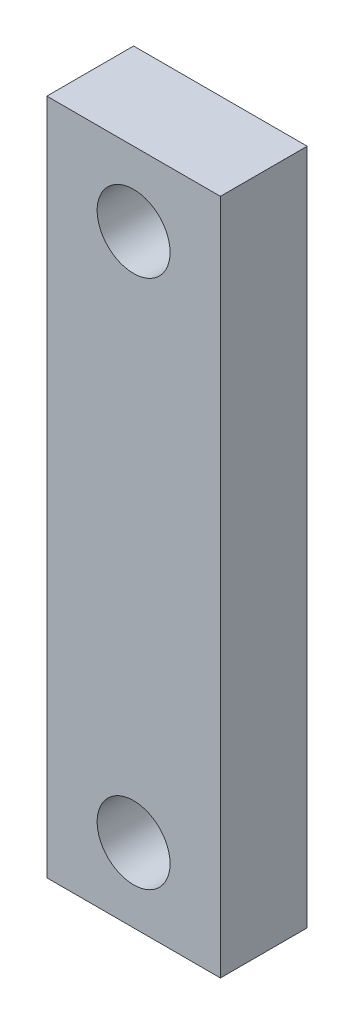
ISO-10303-21;
HEADER;
FILE_DESCRIPTION(('STEP AP214'),'2;1');
FILE_NAME('part.step','',(''),(''),'','','');
FILE_SCHEMA(('AUTOMOTIVE_DESIGN { 1 0 10303 214 1 1 1 1 }'));
ENDSEC;
DATA;
#1=APPLICATION_CONTEXT('core data for automotive mechanical design processes');
#2=APPLICATION_PROTOCOL_DEFINITION('international standard','automotive_design',2000,#1);
#3=PRODUCT_CONTEXT('',#1,'mechanical');
#4=PRODUCT('Part','Part','',(#3));
#5=PRODUCT_RELATED_PRODUCT_CATEGORY('part','',(#4));
#6=PRODUCT_DEFINITION_FORMATION('','',#4);
#7=PRODUCT_DEFINITION_CONTEXT('part definition',#1,'design');
#8=PRODUCT_DEFINITION('design','',#6,#7);
#9=PRODUCT_DEFINITION_SHAPE('','',#8);
#10=(LENGTH_UNIT() NAMED_UNIT(*) SI_UNIT(.MILLI.,.METRE.));
#11=(NAMED_UNIT(*) PLANE_ANGLE_UNIT() SI_UNIT($,.RADIAN.));
#12=(NAMED_UNIT(*) SI_UNIT($,.STERADIAN.) SOLID_ANGLE_UNIT());
#13=UNCERTAINTY_MEASURE_WITH_UNIT(LENGTH_MEASURE(1.E-05),#10,'distance_accuracy_value','');
#14=(GEOMETRIC_REPRESENTATION_CONTEXT(3) GLOBAL_UNCERTAINTY_ASSIGNED_CONTEXT((#13)) GLOBAL_UNIT_ASSIGNED_CONTEXT((#10,
#11,#12)) REPRESENTATION_CONTEXT('',''));
#15=CARTESIAN_POINT('',(0.,0.,0.));
#16=DIRECTION('',(0.,0.,1.));
#17=DIRECTION('',(1.,0.,0.));
#18=AXIS2_PLACEMENT_3D('',#15,#16,#17);
#19=CARTESIAN_POINT('',(-10.,39.,10.));
#20=DIRECTION('',(1.,0.,0.));
#21=DIRECTION('',(0.,1.,0.));
#22=AXIS2_PLACEMENT_3D('',#19,#20,#21);
#23=PLANE('',#22);
#24=DIRECTION('',(0.,-1.,0.));
#25=VECTOR('',#24,1.);
#26=CARTESIAN_POINT('',(-10.,39.,0.));
#27=LINE('',#26,#25);
#28=CARTESIAN_POINT('',(-10.,39.,0.));
#29=VERTEX_POINT('',#28);
#30=CARTESIAN_POINT('',(-10.,-39.,0.));
#31=VERTEX_POINT('',#30);
#32=EDGE_CURVE('E107',#29,#31,#27,.T.);
#33=ORIENTED_EDGE('',*,*,#32,.T.);
#34=DIRECTION('',(0.,0.,-1.));
#35=VECTOR('',#34,1.);
#36=CARTESIAN_POINT('',(-10.,-39.,10.));
#37=LINE('',#36,#35);
#38=CARTESIAN_POINT('',(-10.,-39.,10.));
#39=VERTEX_POINT('',#38);
#40=EDGE_CURVE('E11',#39,#31,#37,.T.);
#41=ORIENTED_EDGE('',*,*,#40,.F.);
#42=DIRECTION('',(0.,-1.,0.));
#43=VECTOR('',#42,1.);
#44=CARTESIAN_POINT('',(-10.,39.,10.));
#45=LINE('',#44,#43);
#46=CARTESIAN_POINT('',(-10.,39.,10.));
#47=VERTEX_POINT('',#46);
#48=EDGE_CURVE('E91',#47,#39,#45,.T.);
#49=ORIENTED_EDGE('',*,*,#48,.F.);
#50=DIRECTION('',(0.,0.,-1.));
#51=VECTOR('',#50,1.);
#52=CARTESIAN_POINT('',(-10.,39.,10.));
#53=LINE('',#52,#51);
#54=EDGE_CURVE('E103',#47,#29,#53,.T.);
#55=ORIENTED_EDGE('',*,*,#54,.T.);
#56=EDGE_LOOP('',(#33,#41,#49,#55));
#57=FACE_BOUND('',#56,.T.);
#58=ADVANCED_FACE('F39',(#57),#23,.F.);
#59=CARTESIAN_POINT('',(10.,-39.,10.));
#60=DIRECTION('',(0.,1.,0.));
#61=DIRECTION('',(-1.,0.,0.));
#62=AXIS2_PLACEMENT_3D('',#59,#60,#61);
#63=PLANE('',#62);
#64=DIRECTION('',(1.,0.,0.));
#65=VECTOR('',#64,1.);
#66=CARTESIAN_POINT('',(10.,-39.,0.));
#67=LINE('',#66,#65);
#68=CARTESIAN_POINT('',(10.,-39.,0.));
#69=VERTEX_POINT('',#68);
#70=EDGE_CURVE('E96',#31,#69,#67,.T.);
#71=ORIENTED_EDGE('',*,*,#70,.T.);
#72=DIRECTION('',(0.,0.,-1.));
#73=VECTOR('',#72,1.);
#74=CARTESIAN_POINT('',(10.,-39.,10.));
#75=LINE('',#74,#73);
#76=CARTESIAN_POINT('',(10.,-39.,10.));
#77=VERTEX_POINT('',#76);
#78=EDGE_CURVE('E48',#77,#69,#75,.T.);
#79=ORIENTED_EDGE('',*,*,#78,.F.);
#80=DIRECTION('',(1.,0.,0.));
#81=VECTOR('',#80,1.);
#82=CARTESIAN_POINT('',(10.,-39.,10.));
#83=LINE('',#82,#81);
#84=EDGE_CURVE('E86',#39,#77,#83,.T.);
#85=ORIENTED_EDGE('',*,*,#84,.F.);
#86=ORIENTED_EDGE('',*,*,#40,.T.);
#87=EDGE_LOOP('',(#71,#79,#85,#86));
#88=FACE_BOUND('',#87,.T.);
#89=ADVANCED_FACE('F95',(#88),#63,.F.);
#90=CARTESIAN_POINT('',(9.99999999999999,39.,10.));
#91=DIRECTION('',(-1.,0.,0.));
#92=DIRECTION('',(0.,-1.,0.));
#93=AXIS2_PLACEMENT_3D('',#90,#91,#92);
#94=PLANE('',#93);
#95=DIRECTION('',(0.,1.,0.));
#96=VECTOR('',#95,1.);
#97=CARTESIAN_POINT('',(9.99999999999999,39.,0.));
#98=LINE('',#97,#96);
#99=CARTESIAN_POINT('',(9.99999999999999,39.,0.));
#100=VERTEX_POINT('',#99);
#101=EDGE_CURVE('E73',#69,#100,#98,.T.);
#102=ORIENTED_EDGE('',*,*,#101,.T.);
#103=DIRECTION('',(0.,0.,-1.));
#104=VECTOR('',#103,1.);
#105=CARTESIAN_POINT('',(9.99999999999999,39.,10.));
#106=LINE('',#105,#104);
#107=CARTESIAN_POINT('',(9.99999999999999,39.,10.));
#108=VERTEX_POINT('',#107);
#109=EDGE_CURVE('E98',#108,#100,#106,.T.);
#110=ORIENTED_EDGE('',*,*,#109,.F.);
#111=DIRECTION('',(0.,1.,0.));
#112=VECTOR('',#111,1.);
#113=CARTESIAN_POINT('',(9.99999999999999,39.,10.));
#114=LINE('',#113,#112);
#115=EDGE_CURVE('E89',#77,#108,#114,.T.);
#116=ORIENTED_EDGE('',*,*,#115,.F.);
#117=ORIENTED_EDGE('',*,*,#78,.T.);
#118=EDGE_LOOP('',(#102,#110,#116,#117));
#119=FACE_BOUND('',#118,.T.);
#120=ADVANCED_FACE('F99',(#119),#94,.F.);
#121=CARTESIAN_POINT('',(9.99999999999999,39.,10.));
#122=DIRECTION('',(0.,-1.,0.));
#123=DIRECTION('',(0.,0.,-1.));
#124=AXIS2_PLACEMENT_3D('',#121,#122,#123);
#125=PLANE('',#124);
#126=DIRECTION('',(-1.,0.,0.));
#127=VECTOR('',#126,1.);
#128=CARTESIAN_POINT('',(9.99999999999999,39.,0.));
#129=LINE('',#128,#127);
#130=EDGE_CURVE('E79',#100,#29,#129,.T.);
#131=ORIENTED_EDGE('',*,*,#130,.T.);
#132=ORIENTED_EDGE('',*,*,#54,.F.);
#133=DIRECTION('',(-1.,0.,0.));
#134=VECTOR('',#133,1.);
#135=CARTESIAN_POINT('',(9.99999999999999,39.,10.));
#136=LINE('',#135,#134);
#137=EDGE_CURVE('E56',#108,#47,#136,.T.);
#138=ORIENTED_EDGE('',*,*,#137,.F.);
#139=ORIENTED_EDGE('',*,*,#109,.T.);
#140=EDGE_LOOP('',(#131,#132,#138,#139));
#141=FACE_BOUND('',#140,.T.);
#142=ADVANCED_FACE('F121',(#141),#125,.F.);
#143=CARTESIAN_POINT('',(0.,0.,10.));
#144=DIRECTION('',(0.,0.,-1.));
#145=DIRECTION('',(-1.,0.,0.));
#146=AXIS2_PLACEMENT_3D('',#143,#144,#145);
#147=PLANE('',#146);
#148=CARTESIAN_POINT('',(0.,30.5,10.));
#149=DIRECTION('',(0.,0.,1.));
#150=DIRECTION('',(1.,0.,0.));
#151=AXIS2_PLACEMENT_3D('',#148,#149,#150);
#152=CIRCLE('',#151,4.2);
#153=CARTESIAN_POINT('',(4.2,30.5,10.));
#154=VERTEX_POINT('',#153);
#155=EDGE_CURVE('E139',#154,#154,#152,.T.);
#156=ORIENTED_EDGE('',*,*,#155,.F.);
#157=EDGE_LOOP('',(#156));
#158=FACE_BOUND('',#157,.T.);
#159=CARTESIAN_POINT('',(0.,-30.5,10.));
#160=DIRECTION('',(0.,0.,1.));
#161=DIRECTION('',(1.,0.,0.));
#162=AXIS2_PLACEMENT_3D('',#159,#160,#161);
#163=CIRCLE('',#162,4.2);
#164=CARTESIAN_POINT('',(4.2,-30.5,10.));
#165=VERTEX_POINT('',#164);
#166=EDGE_CURVE('E131',#165,#165,#163,.T.);
#167=ORIENTED_EDGE('',*,*,#166,.F.);
#168=EDGE_LOOP('',(#167));
#169=FACE_BOUND('',#168,.T.);
#170=ORIENTED_EDGE('',*,*,#48,.T.);
#171=ORIENTED_EDGE('',*,*,#84,.T.);
#172=ORIENTED_EDGE('',*,*,#115,.T.);
#173=ORIENTED_EDGE('',*,*,#137,.T.);
#174=EDGE_LOOP('',(#170,#171,#172,#173));
#175=FACE_BOUND('',#174,.T.);
#176=ADVANCED_FACE('F87',(#158,#169,#175),#147,.F.);
#177=CARTESIAN_POINT('',(0.,0.,0.));
#178=DIRECTION('',(0.,0.,-1.));
#179=DIRECTION('',(-1.,0.,0.));
#180=AXIS2_PLACEMENT_3D('',#177,#178,#179);
#181=PLANE('',#180);
#182=CARTESIAN_POINT('',(0.,30.5,0.));
#183=DIRECTION('',(0.,0.,1.));
#184=DIRECTION('',(1.,0.,0.));
#185=AXIS2_PLACEMENT_3D('',#182,#183,#184);
#186=CIRCLE('',#185,4.2);
#187=CARTESIAN_POINT('',(4.2,30.5,0.));
#188=VERTEX_POINT('',#187);
#189=EDGE_CURVE('E135',#188,#188,#186,.T.);
#190=ORIENTED_EDGE('',*,*,#189,.T.);
#191=EDGE_LOOP('',(#190));
#192=FACE_BOUND('',#191,.T.);
#193=CARTESIAN_POINT('',(0.,-30.5,0.));
#194=DIRECTION('',(0.,0.,1.));
#195=DIRECTION('',(1.,0.,0.));
#196=AXIS2_PLACEMENT_3D('',#193,#194,#195);
#197=CIRCLE('',#196,4.2);
#198=CARTESIAN_POINT('',(4.2,-30.5,0.));
#199=VERTEX_POINT('',#198);
#200=EDGE_CURVE('E111',#199,#199,#197,.T.);
#201=ORIENTED_EDGE('',*,*,#200,.T.);
#202=EDGE_LOOP('',(#201));
#203=FACE_BOUND('',#202,.T.);
#204=ORIENTED_EDGE('',*,*,#32,.F.);
#205=ORIENTED_EDGE('',*,*,#130,.F.);
#206=ORIENTED_EDGE('',*,*,#101,.F.);
#207=ORIENTED_EDGE('',*,*,#70,.F.);
#208=EDGE_LOOP('',(#204,#205,#206,#207));
#209=FACE_BOUND('',#208,.T.);
#210=ADVANCED_FACE('F124',(#192,#203,#209),#181,.T.);
#211=CARTESIAN_POINT('',(0.,-30.5,10.));
#212=DIRECTION('',(0.,0.,1.));
#213=DIRECTION('',(1.,0.,0.));
#214=AXIS2_PLACEMENT_3D('',#211,#212,#213);
#215=CYLINDRICAL_SURFACE('',#214,4.2);
#216=ORIENTED_EDGE('',*,*,#200,.F.);
#217=EDGE_LOOP('',(#216));
#218=FACE_BOUND('',#217,.T.);
#219=ORIENTED_EDGE('',*,*,#166,.T.);
#220=EDGE_LOOP('',(#219));
#221=FACE_BOUND('',#220,.T.);
#222=ADVANCED_FACE('F151',(#218,#221),#215,.F.);
#223=CARTESIAN_POINT('',(0.,30.5,10.));
#224=DIRECTION('',(0.,0.,1.));
#225=DIRECTION('',(1.,0.,0.));
#226=AXIS2_PLACEMENT_3D('',#223,#224,#225);
#227=CYLINDRICAL_SURFACE('',#226,4.2);
#228=ORIENTED_EDGE('',*,*,#189,.F.);
#229=EDGE_LOOP('',(#228));
#230=FACE_BOUND('',#229,.T.);
#231=ORIENTED_EDGE('',*,*,#155,.T.);
#232=EDGE_LOOP('',(#231));
#233=FACE_BOUND('',#232,.T.);
#234=ADVANCED_FACE('F144',(#230,#233),#227,.F.);
#235=CLOSED_SHELL('',(#58,#89,#120,#142,#176,#210,#222,#234));
#236=MANIFOLD_SOLID_BREP('B2',#235);
#237=ADVANCED_BREP_SHAPE_REPRESENTATION('',(#18,#236),#14);
#238=SHAPE_DEFINITION_REPRESENTATION(#9,#237);
ENDSEC;
END-ISO-10303-21;
